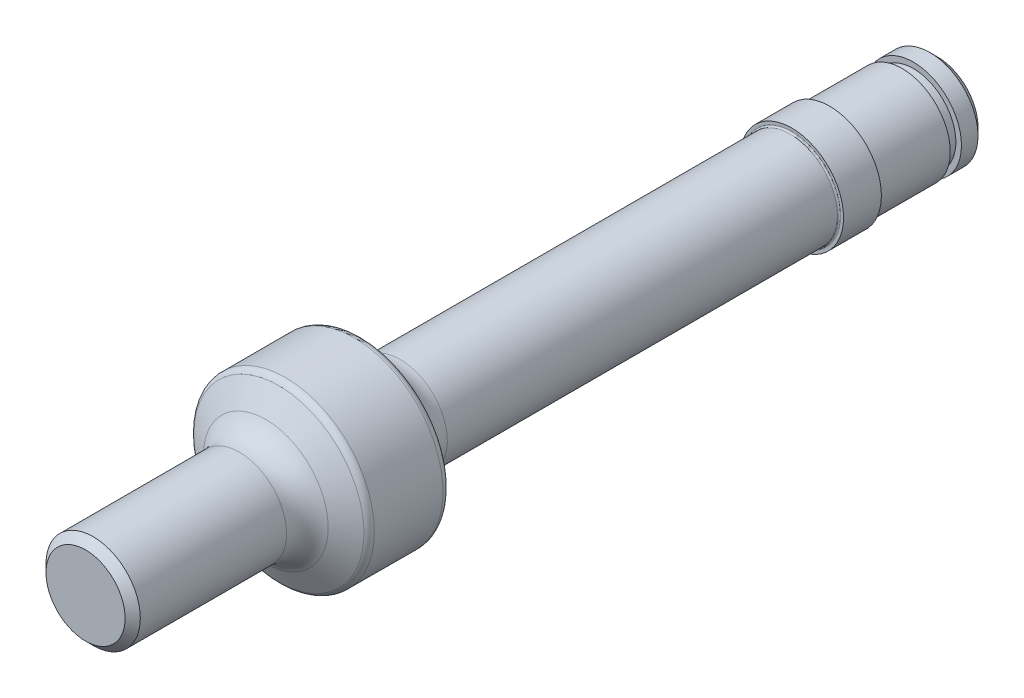
ISO-10303-21;
HEADER;
FILE_DESCRIPTION(('STEP AP214'),'2;1');
FILE_NAME('part.step','',(''),(''),'','','');
FILE_SCHEMA(('AUTOMOTIVE_DESIGN { 1 0 10303 214 1 1 1 1 }'));
ENDSEC;
DATA;
#1=APPLICATION_CONTEXT('core data for automotive mechanical design processes');
#2=APPLICATION_PROTOCOL_DEFINITION('international standard','automotive_design',2000,#1);
#3=PRODUCT_CONTEXT('',#1,'mechanical');
#4=PRODUCT('Part','Part','',(#3));
#5=PRODUCT_RELATED_PRODUCT_CATEGORY('part','',(#4));
#6=PRODUCT_DEFINITION_FORMATION('','',#4);
#7=PRODUCT_DEFINITION_CONTEXT('part definition',#1,'design');
#8=PRODUCT_DEFINITION('design','',#6,#7);
#9=PRODUCT_DEFINITION_SHAPE('','',#8);
#10=(LENGTH_UNIT() NAMED_UNIT(*) SI_UNIT(.MILLI.,.METRE.));
#11=(NAMED_UNIT(*) PLANE_ANGLE_UNIT() SI_UNIT($,.RADIAN.));
#12=(NAMED_UNIT(*) SI_UNIT($,.STERADIAN.) SOLID_ANGLE_UNIT());
#13=UNCERTAINTY_MEASURE_WITH_UNIT(LENGTH_MEASURE(1.E-05),#10,'distance_accuracy_value','');
#14=(GEOMETRIC_REPRESENTATION_CONTEXT(3) GLOBAL_UNCERTAINTY_ASSIGNED_CONTEXT((#13)) GLOBAL_UNIT_ASSIGNED_CONTEXT((#10,
#11,#12)) REPRESENTATION_CONTEXT('',''));
#15=CARTESIAN_POINT('',(0.,0.,0.));
#16=DIRECTION('',(0.,0.,1.));
#17=DIRECTION('',(1.,0.,0.));
#18=AXIS2_PLACEMENT_3D('',#15,#16,#17);
#19=CARTESIAN_POINT('',(0.,3.1623,-40.6019));
#20=DIRECTION('',(0.,0.,1.));
#21=DIRECTION('',(1.,0.,0.));
#22=AXIS2_PLACEMENT_3D('',#19,#20,#21);
#23=PLANE('',#22);
#24=CARTESIAN_POINT('',(0.,0.,-40.6019000000697));
#25=DIRECTION('',(0.,0.,1.));
#26=DIRECTION('',(1.,0.,0.));
#27=AXIS2_PLACEMENT_3D('',#24,#25,#26);
#28=CIRCLE('',#27,2.66229999999723);
#29=CARTESIAN_POINT('',(2.66229999999723,0.,-40.6019000000697));
#30=VERTEX_POINT('',#29);
#31=EDGE_CURVE('E257',#30,#30,#28,.T.);
#32=ORIENTED_EDGE('',*,*,#31,.F.);
#33=EDGE_LOOP('',(#32));
#34=FACE_BOUND('',#33,.T.);
#35=ADVANCED_FACE('F16',(#34),#23,.F.);
#36=CARTESIAN_POINT('',(0.,0.,-40.1019000000247));
#37=DIRECTION('',(0.,0.,1.));
#38=DIRECTION('',(1.,0.,0.));
#39=AXIS2_PLACEMENT_3D('',#36,#37,#38);
#40=CONICAL_SURFACE('',#39,3.16230000004225,0.785398163397448);
#41=ORIENTED_EDGE('',*,*,#31,.T.);
#42=EDGE_LOOP('',(#41));
#43=FACE_BOUND('',#42,.T.);
#44=CARTESIAN_POINT('',(0.,0.,-40.1019));
#45=DIRECTION('',(0.,0.,1.));
#46=DIRECTION('',(1.,0.,0.));
#47=AXIS2_PLACEMENT_3D('',#44,#45,#46);
#48=CIRCLE('',#47,3.1623);
#49=CARTESIAN_POINT('',(3.1623,0.,-40.1019));
#50=VERTEX_POINT('',#49);
#51=EDGE_CURVE('E256',#50,#50,#48,.T.);
#52=ORIENTED_EDGE('',*,*,#51,.F.);
#53=EDGE_LOOP('',(#52));
#54=FACE_BOUND('',#53,.T.);
#55=ADVANCED_FACE('F148',(#43,#54),#40,.T.);
#56=CARTESIAN_POINT('',(0.,0.,26.453846));
#57=DIRECTION('',(0.,0.,1.));
#58=DIRECTION('',(1.,0.,0.));
#59=AXIS2_PLACEMENT_3D('',#56,#57,#58);
#60=CYLINDRICAL_SURFACE('',#59,3.1623);
#61=ORIENTED_EDGE('',*,*,#51,.T.);
#62=EDGE_LOOP('',(#61));
#63=FACE_BOUND('',#62,.T.);
#64=CARTESIAN_POINT('',(0.,0.,-39.0144));
#65=DIRECTION('',(0.,0.,1.));
#66=DIRECTION('',(1.,0.,0.));
#67=AXIS2_PLACEMENT_3D('',#64,#65,#66);
#68=CIRCLE('',#67,3.1623);
#69=CARTESIAN_POINT('',(3.1623,0.,-39.0144));
#70=VERTEX_POINT('',#69);
#71=EDGE_CURVE('E253',#70,#70,#68,.F.);
#72=ORIENTED_EDGE('',*,*,#71,.T.);
#73=EDGE_LOOP('',(#72));
#74=FACE_BOUND('',#73,.T.);
#75=ADVANCED_FACE('F145',(#63,#74),#60,.T.);
#76=CARTESIAN_POINT('',(0.,3.10000000000002,15.3981));
#77=DIRECTION('',(0.,0.,-1.));
#78=DIRECTION('',(-1.,0.,0.));
#79=AXIS2_PLACEMENT_3D('',#76,#77,#78);
#80=PLANE('',#79);
#81=CARTESIAN_POINT('',(0.,0.,15.3980999999703));
#82=DIRECTION('',(0.,0.,-1.));
#83=DIRECTION('',(-1.,0.,0.));
#84=AXIS2_PLACEMENT_3D('',#81,#82,#83);
#85=CIRCLE('',#84,2.59999999991578);
#86=CARTESIAN_POINT('',(-2.59999999991578,0.,15.3980999999703));
#87=VERTEX_POINT('',#86);
#88=EDGE_CURVE('E250',#87,#87,#85,.T.);
#89=ORIENTED_EDGE('',*,*,#88,.F.);
#90=EDGE_LOOP('',(#89));
#91=FACE_BOUND('',#90,.T.);
#92=ADVANCED_FACE('F141',(#91),#80,.F.);
#93=CARTESIAN_POINT('',(0.,2.794,-39.0144));
#94=DIRECTION('',(0.,0.,-1.));
#95=DIRECTION('',(-1.,0.,0.));
#96=AXIS2_PLACEMENT_3D('',#93,#94,#95);
#97=PLANE('',#96);
#98=CARTESIAN_POINT('',(0.,0.,-39.0144));
#99=DIRECTION('',(0.,0.,-1.));
#100=DIRECTION('',(-1.,0.,0.));
#101=AXIS2_PLACEMENT_3D('',#98,#99,#100);
#102=CIRCLE('',#101,2.794);
#103=CARTESIAN_POINT('',(-2.794,0.,-39.0144));
#104=VERTEX_POINT('',#103);
#105=EDGE_CURVE('E247',#104,#104,#102,.F.);
#106=ORIENTED_EDGE('',*,*,#105,.F.);
#107=EDGE_LOOP('',(#106));
#108=FACE_BOUND('',#107,.T.);
#109=ORIENTED_EDGE('',*,*,#71,.F.);
#110=EDGE_LOOP('',(#109));
#111=FACE_BOUND('',#110,.T.);
#112=ADVANCED_FACE('F137',(#108,#111),#97,.F.);
#113=CARTESIAN_POINT('',(0.,0.,14.898100000039));
#114=DIRECTION('',(0.,0.,-1.));
#115=DIRECTION('',(-1.,0.,0.));
#116=AXIS2_PLACEMENT_3D('',#113,#114,#115);
#117=CONICAL_SURFACE('',#116,3.09999999984711,0.785398163397448);
#118=CARTESIAN_POINT('',(0.,0.,14.8981));
#119=DIRECTION('',(0.,0.,1.));
#120=DIRECTION('',(1.,0.,0.));
#121=AXIS2_PLACEMENT_3D('',#118,#119,#120);
#122=CIRCLE('',#121,3.10000000000001);
#123=CARTESIAN_POINT('',(3.10000000000001,0.,14.8981));
#124=VERTEX_POINT('',#123);
#125=EDGE_CURVE('E246',#124,#124,#122,.F.);
#126=ORIENTED_EDGE('',*,*,#125,.F.);
#127=EDGE_LOOP('',(#126));
#128=FACE_BOUND('',#127,.T.);
#129=ORIENTED_EDGE('',*,*,#88,.T.);
#130=EDGE_LOOP('',(#129));
#131=FACE_BOUND('',#130,.T.);
#132=ADVANCED_FACE('F133',(#128,#131),#117,.T.);
#133=CARTESIAN_POINT('',(0.,0.,-40.0654390361338));
#134=DIRECTION('',(0.,0.,-1.));
#135=DIRECTION('',(-1.,0.,0.));
#136=AXIS2_PLACEMENT_3D('',#133,#134,#135);
#137=CYLINDRICAL_SURFACE('',#136,2.794);
#138=ORIENTED_EDGE('',*,*,#105,.T.);
#139=EDGE_LOOP('',(#138));
#140=FACE_BOUND('',#139,.T.);
#141=CARTESIAN_POINT('',(0.,0.,-38.2778));
#142=DIRECTION('',(0.,0.,-1.));
#143=DIRECTION('',(-1.,0.,0.));
#144=AXIS2_PLACEMENT_3D('',#141,#142,#143);
#145=CIRCLE('',#144,2.794);
#146=CARTESIAN_POINT('',(-2.794,0.,-38.2778));
#147=VERTEX_POINT('',#146);
#148=EDGE_CURVE('E243',#147,#147,#145,.T.);
#149=ORIENTED_EDGE('',*,*,#148,.T.);
#150=EDGE_LOOP('',(#149));
#151=FACE_BOUND('',#150,.T.);
#152=ADVANCED_FACE('F129',(#140,#151),#137,.T.);
#153=CARTESIAN_POINT('',(0.,0.,26.453846));
#154=DIRECTION('',(0.,0.,1.));
#155=DIRECTION('',(1.,0.,0.));
#156=AXIS2_PLACEMENT_3D('',#153,#154,#155);
#157=CYLINDRICAL_SURFACE('',#156,3.10000000000001);
#158=CARTESIAN_POINT('',(0.,0.,5.28374149423676));
#159=DIRECTION('',(0.,0.,1.));
#160=DIRECTION('',(1.,0.,0.));
#161=AXIS2_PLACEMENT_3D('',#158,#159,#160);
#162=CIRCLE('',#161,3.10000000000001);
#163=CARTESIAN_POINT('',(3.10000000000001,0.,5.28374149423676));
#164=VERTEX_POINT('',#163);
#165=EDGE_CURVE('E114',#164,#164,#162,.T.);
#166=ORIENTED_EDGE('',*,*,#165,.T.);
#167=EDGE_LOOP('',(#166));
#168=FACE_BOUND('',#167,.T.);
#169=ORIENTED_EDGE('',*,*,#125,.T.);
#170=EDGE_LOOP('',(#169));
#171=FACE_BOUND('',#170,.T.);
#172=ADVANCED_FACE('F125',(#168,#171),#157,.T.);
#173=CARTESIAN_POINT('',(0.,2.794,-38.2778));
#174=DIRECTION('',(0.,0.,1.));
#175=DIRECTION('',(1.,0.,0.));
#176=AXIS2_PLACEMENT_3D('',#173,#174,#175);
#177=PLANE('',#176);
#178=CARTESIAN_POINT('',(0.,0.,-38.2778));
#179=DIRECTION('',(0.,0.,1.));
#180=DIRECTION('',(1.,0.,0.));
#181=AXIS2_PLACEMENT_3D('',#178,#179,#180);
#182=CIRCLE('',#181,3.1623);
#183=CARTESIAN_POINT('',(3.1623,0.,-38.2778));
#184=VERTEX_POINT('',#183);
#185=EDGE_CURVE('E109',#184,#184,#182,.T.);
#186=ORIENTED_EDGE('',*,*,#185,.F.);
#187=EDGE_LOOP('',(#186));
#188=FACE_BOUND('',#187,.T.);
#189=ORIENTED_EDGE('',*,*,#148,.F.);
#190=EDGE_LOOP('',(#189));
#191=FACE_BOUND('',#190,.T.);
#192=ADVANCED_FACE('F121',(#188,#191),#177,.F.);
#193=CARTESIAN_POINT('',(0.,0.,5.28374149423676));
#194=DIRECTION('',(0.,0.,1.));
#195=DIRECTION('',(1.,0.,0.));
#196=AXIS2_PLACEMENT_3D('',#193,#194,#195);
#197=TOROIDAL_SURFACE('',#196,5.10000000000001,2.);
#198=CARTESIAN_POINT('',(0.,0.,3.55169068666328));
#199=DIRECTION('',(0.,0.,-1.));
#200=DIRECTION('',(-1.,0.,0.));
#201=AXIS2_PLACEMENT_3D('',#198,#199,#200);
#202=CIRCLE('',#201,4.099999999994);
#203=CARTESIAN_POINT('',(-4.099999999994,0.,3.55169068666328));
#204=VERTEX_POINT('',#203);
#205=EDGE_CURVE('E101',#204,#204,#202,.T.);
#206=ORIENTED_EDGE('',*,*,#205,.F.);
#207=EDGE_LOOP('',(#206));
#208=FACE_BOUND('',#207,.T.);
#209=ORIENTED_EDGE('',*,*,#165,.F.);
#210=EDGE_LOOP('',(#209));
#211=FACE_BOUND('',#210,.T.);
#212=ADVANCED_FACE('F117',(#208,#211),#197,.F.);
#213=CARTESIAN_POINT('',(0.,0.,26.453846));
#214=DIRECTION('',(0.,0.,1.));
#215=DIRECTION('',(1.,0.,0.));
#216=AXIS2_PLACEMENT_3D('',#213,#214,#215);
#217=CYLINDRICAL_SURFACE('',#216,3.1623);
#218=CARTESIAN_POINT('',(0.,0.,-33.6153));
#219=DIRECTION('',(0.,0.,1.));
#220=DIRECTION('',(1.,0.,0.));
#221=AXIS2_PLACEMENT_3D('',#218,#219,#220);
#222=CIRCLE('',#221,3.1623);
#223=CARTESIAN_POINT('',(3.1623,0.,-33.6153));
#224=VERTEX_POINT('',#223);
#225=EDGE_CURVE('E90',#224,#224,#222,.F.);
#226=ORIENTED_EDGE('',*,*,#225,.T.);
#227=EDGE_LOOP('',(#226));
#228=FACE_BOUND('',#227,.T.);
#229=ORIENTED_EDGE('',*,*,#185,.T.);
#230=EDGE_LOOP('',(#229));
#231=FACE_BOUND('',#230,.T.);
#232=ADVANCED_FACE('F120',(#228,#231),#217,.T.);
#233=CARTESIAN_POINT('',(0.,0.,2.69028408507666));
#234=DIRECTION('',(0.,0.,-1.));
#235=DIRECTION('',(-1.,0.,0.));
#236=AXIS2_PLACEMENT_3D('',#233,#234,#235);
#237=CONICAL_SURFACE('',#236,5.59199999992188,1.04719755119794);
#238=CARTESIAN_POINT('',(0.,0.,2.69028408503697));
#239=DIRECTION('',(0.,0.,-1.));
#240=DIRECTION('',(-1.,0.,0.));
#241=AXIS2_PLACEMENT_3D('',#238,#239,#240);
#242=CIRCLE('',#241,5.59199999999999);
#243=CARTESIAN_POINT('',(-5.59199999999999,0.,2.69028408503697));
#244=VERTEX_POINT('',#243);
#245=EDGE_CURVE('E57',#244,#244,#242,.T.);
#246=ORIENTED_EDGE('',*,*,#245,.F.);
#247=EDGE_LOOP('',(#246));
#248=FACE_BOUND('',#247,.T.);
#249=ORIENTED_EDGE('',*,*,#205,.T.);
#250=EDGE_LOOP('',(#249));
#251=FACE_BOUND('',#250,.T.);
#252=ADVANCED_FACE('F95',(#248,#251),#237,.T.);
#253=CARTESIAN_POINT('',(0.,0.,-33.6153));
#254=DIRECTION('',(0.,0.,1.));
#255=DIRECTION('',(1.,0.,0.));
#256=AXIS2_PLACEMENT_3D('',#253,#254,#255);
#257=TOROIDAL_SURFACE('',#256,3.2623,0.1);
#258=CARTESIAN_POINT('',(0.,0.,-33.5153));
#259=DIRECTION('',(0.,0.,-1.));
#260=DIRECTION('',(-1.,0.,0.));
#261=AXIS2_PLACEMENT_3D('',#258,#259,#260);
#262=CIRCLE('',#261,3.2623);
#263=CARTESIAN_POINT('',(-3.2623,0.,-33.5153));
#264=VERTEX_POINT('',#263);
#265=CARTESIAN_POINT('',(3.2623,0.,-33.5153));
#266=VERTEX_POINT('',#265);
#267=EDGE_CURVE('E46',#264,#266,#262,.T.);
#268=ORIENTED_EDGE('',*,*,#267,.T.);
#269=CARTESIAN_POINT('',(0.,0.,-33.5153));
#270=DIRECTION('',(0.,0.,-1.));
#271=DIRECTION('',(1.,0.,0.));
#272=AXIS2_PLACEMENT_3D('',#269,#270,#271);
#273=CIRCLE('',#272,3.2623);
#274=EDGE_CURVE('E44',#266,#264,#273,.T.);
#275=ORIENTED_EDGE('',*,*,#274,.T.);
#276=EDGE_LOOP('',(#268,#275));
#277=FACE_BOUND('',#276,.T.);
#278=ORIENTED_EDGE('',*,*,#225,.F.);
#279=EDGE_LOOP('',(#278));
#280=FACE_BOUND('',#279,.T.);
#281=ADVANCED_FACE('F48',(#277,#280),#257,.F.);
#282=CARTESIAN_POINT('',(0.,0.,2.25727138314476));
#283=DIRECTION('',(0.,0.,-1.));
#284=DIRECTION('',(-1.,0.,0.));
#285=AXIS2_PLACEMENT_3D('',#282,#283,#284);
#286=TOROIDAL_SURFACE('',#285,5.34199999999999,0.5);
#287=CARTESIAN_POINT('',(0.,0.,2.25727138314476));
#288=DIRECTION('',(0.,0.,1.));
#289=DIRECTION('',(1.,0.,0.));
#290=AXIS2_PLACEMENT_3D('',#287,#288,#289);
#291=CIRCLE('',#290,5.842);
#292=CARTESIAN_POINT('',(5.842,0.,2.25727138314476));
#293=VERTEX_POINT('',#292);
#294=EDGE_CURVE('E52',#293,#293,#291,.F.);
#295=ORIENTED_EDGE('',*,*,#294,.F.);
#296=EDGE_LOOP('',(#295));
#297=FACE_BOUND('',#296,.T.);
#298=ORIENTED_EDGE('',*,*,#245,.T.);
#299=EDGE_LOOP('',(#298));
#300=FACE_BOUND('',#299,.T.);
#301=ADVANCED_FACE('F75',(#297,#300),#286,.T.);
#302=CARTESIAN_POINT('',(0.,3.4,-33.5153));
#303=DIRECTION('',(0.,0.,1.));
#304=DIRECTION('',(1.,0.,0.));
#305=AXIS2_PLACEMENT_3D('',#302,#303,#304);
#306=PLANE('',#305);
#307=CARTESIAN_POINT('',(0.,0.,-33.5153));
#308=DIRECTION('',(0.,0.,1.));
#309=DIRECTION('',(1.,0.,0.));
#310=AXIS2_PLACEMENT_3D('',#307,#308,#309);
#311=CIRCLE('',#310,3.4);
#312=CARTESIAN_POINT('',(3.4,0.,-33.5153));
#313=VERTEX_POINT('',#312);
#314=EDGE_CURVE('E229',#313,#313,#311,.T.);
#315=ORIENTED_EDGE('',*,*,#314,.F.);
#316=EDGE_LOOP('',(#315));
#317=FACE_BOUND('',#316,.T.);
#318=ORIENTED_EDGE('',*,*,#274,.F.);
#319=ORIENTED_EDGE('',*,*,#267,.F.);
#320=EDGE_LOOP('',(#318,#319));
#321=FACE_BOUND('',#320,.T.);
#322=ADVANCED_FACE('F56',(#317,#321),#306,.F.);
#323=CARTESIAN_POINT('',(0.,0.,26.453846));
#324=DIRECTION('',(0.,0.,1.));
#325=DIRECTION('',(1.,0.,0.));
#326=AXIS2_PLACEMENT_3D('',#323,#324,#325);
#327=CYLINDRICAL_SURFACE('',#326,5.842);
#328=CARTESIAN_POINT('',(0.,0.,-2.25727138314476));
#329=DIRECTION('',(0.,0.,-1.));
#330=DIRECTION('',(-1.,0.,0.));
#331=AXIS2_PLACEMENT_3D('',#328,#329,#330);
#332=CIRCLE('',#331,5.842);
#333=CARTESIAN_POINT('',(-5.842,0.,-2.25727138314476));
#334=VERTEX_POINT('',#333);
#335=EDGE_CURVE('E226',#334,#334,#332,.T.);
#336=ORIENTED_EDGE('',*,*,#335,.F.);
#337=EDGE_LOOP('',(#336));
#338=FACE_BOUND('',#337,.T.);
#339=ORIENTED_EDGE('',*,*,#294,.T.);
#340=EDGE_LOOP('',(#339));
#341=FACE_BOUND('',#340,.T.);
#342=ADVANCED_FACE('F74',(#338,#341),#327,.T.);
#343=CARTESIAN_POINT('',(0.,0.,26.453846));
#344=DIRECTION('',(0.,0.,1.));
#345=DIRECTION('',(1.,0.,0.));
#346=AXIS2_PLACEMENT_3D('',#343,#344,#345);
#347=CYLINDRICAL_SURFACE('',#346,3.4);
#348=CARTESIAN_POINT('',(0.,0.,-31.0261));
#349=DIRECTION('',(0.,0.,1.));
#350=DIRECTION('',(1.,0.,0.));
#351=AXIS2_PLACEMENT_3D('',#348,#349,#350);
#352=CIRCLE('',#351,3.4);
#353=CARTESIAN_POINT('',(3.4,0.,-31.0261));
#354=VERTEX_POINT('',#353);
#355=EDGE_CURVE('E228',#354,#354,#352,.F.);
#356=ORIENTED_EDGE('',*,*,#355,.T.);
#357=EDGE_LOOP('',(#356));
#358=FACE_BOUND('',#357,.T.);
#359=ORIENTED_EDGE('',*,*,#314,.T.);
#360=EDGE_LOOP('',(#359));
#361=FACE_BOUND('',#360,.T.);
#362=ADVANCED_FACE('F282',(#358,#361),#347,.T.);
#363=CARTESIAN_POINT('',(0.,0.,-2.25727138314476));
#364=DIRECTION('',(0.,0.,-1.));
#365=DIRECTION('',(-1.,0.,0.));
#366=AXIS2_PLACEMENT_3D('',#363,#364,#365);
#367=TOROIDAL_SURFACE('',#366,5.34199999999999,0.5);
#368=CARTESIAN_POINT('',(0.,0.,-2.69028408501981));
#369=DIRECTION('',(0.,0.,1.));
#370=DIRECTION('',(1.,0.,0.));
#371=AXIS2_PLACEMENT_3D('',#368,#369,#370);
#372=CIRCLE('',#371,5.59199999997873);
#373=CARTESIAN_POINT('',(5.59199999997872,0.,-2.69028408501981));
#374=VERTEX_POINT('',#373);
#375=EDGE_CURVE('E185',#374,#374,#372,.F.);
#376=ORIENTED_EDGE('',*,*,#375,.F.);
#377=EDGE_LOOP('',(#376));
#378=FACE_BOUND('',#377,.T.);
#379=ORIENTED_EDGE('',*,*,#335,.T.);
#380=EDGE_LOOP('',(#379));
#381=FACE_BOUND('',#380,.T.);
#382=ADVANCED_FACE('F203',(#378,#381),#367,.T.);
#383=CARTESIAN_POINT('',(0.,3.4,-31.0261));
#384=DIRECTION('',(0.,0.,-1.));
#385=DIRECTION('',(-1.,0.,0.));
#386=AXIS2_PLACEMENT_3D('',#383,#384,#385);
#387=PLANE('',#386);
#388=ORIENTED_EDGE('',*,*,#355,.F.);
#389=EDGE_LOOP('',(#388));
#390=FACE_BOUND('',#389,.T.);
#391=CARTESIAN_POINT('',(0.,0.,-31.0261));
#392=DIRECTION('',(0.,0.,1.));
#393=DIRECTION('',(-1.,0.,0.));
#394=AXIS2_PLACEMENT_3D('',#391,#392,#393);
#395=CIRCLE('',#394,3.19999999999995);
#396=CARTESIAN_POINT('',(3.19999999999995,0.,-31.0261));
#397=VERTEX_POINT('',#396);
#398=CARTESIAN_POINT('',(-3.19999999999995,0.,-31.0261));
#399=VERTEX_POINT('',#398);
#400=EDGE_CURVE('E182',#397,#399,#395,.F.);
#401=ORIENTED_EDGE('',*,*,#400,.T.);
#402=CARTESIAN_POINT('',(0.,0.,-31.0261));
#403=DIRECTION('',(0.,0.,1.));
#404=DIRECTION('',(1.,0.,0.));
#405=AXIS2_PLACEMENT_3D('',#402,#403,#404);
#406=CIRCLE('',#405,3.19999999999995);
#407=EDGE_CURVE('E35',#399,#397,#406,.F.);
#408=ORIENTED_EDGE('',*,*,#407,.T.);
#409=EDGE_LOOP('',(#401,#408));
#410=FACE_BOUND('',#409,.T.);
#411=ADVANCED_FACE('F193',(#390,#410),#387,.F.);
#412=CARTESIAN_POINT('',(0.,0.,-2.69028408507666));
#413=DIRECTION('',(0.,0.,1.));
#414=DIRECTION('',(1.,0.,0.));
#415=AXIS2_PLACEMENT_3D('',#412,#413,#414);
#416=CONICAL_SURFACE('',#415,5.59199999992188,1.04719755119794);
#417=ORIENTED_EDGE('',*,*,#375,.T.);
#418=EDGE_LOOP('',(#417));
#419=FACE_BOUND('',#418,.T.);
#420=CARTESIAN_POINT('',(0.,0.,-3.55169068666792));
#421=DIRECTION('',(0.,0.,1.));
#422=DIRECTION('',(1.,0.,0.));
#423=AXIS2_PLACEMENT_3D('',#420,#421,#422);
#424=CIRCLE('',#423,4.09999999999995);
#425=CARTESIAN_POINT('',(4.09999999999995,0.,-3.55169068666792));
#426=VERTEX_POINT('',#425);
#427=EDGE_CURVE('E180',#426,#426,#424,.T.);
#428=ORIENTED_EDGE('',*,*,#427,.T.);
#429=EDGE_LOOP('',(#428));
#430=FACE_BOUND('',#429,.T.);
#431=ADVANCED_FACE('F202',(#419,#430),#416,.T.);
#432=CARTESIAN_POINT('',(0.,0.,-30.9261));
#433=DIRECTION('',(0.,0.,-1.));
#434=DIRECTION('',(-1.,0.,0.));
#435=AXIS2_PLACEMENT_3D('',#432,#433,#434);
#436=TOROIDAL_SURFACE('',#435,3.19999999999995,0.1);
#437=CARTESIAN_POINT('',(0.,0.,-30.9261));
#438=DIRECTION('',(0.,0.,1.));
#439=DIRECTION('',(1.,0.,0.));
#440=AXIS2_PLACEMENT_3D('',#437,#438,#439);
#441=CIRCLE('',#440,3.09999999999995);
#442=CARTESIAN_POINT('',(3.09999999999995,0.,-30.9261));
#443=VERTEX_POINT('',#442);
#444=EDGE_CURVE('E27',#443,#443,#441,.T.);
#445=ORIENTED_EDGE('',*,*,#444,.F.);
#446=EDGE_LOOP('',(#445));
#447=FACE_BOUND('',#446,.T.);
#448=ORIENTED_EDGE('',*,*,#400,.F.);
#449=ORIENTED_EDGE('',*,*,#407,.F.);
#450=EDGE_LOOP('',(#448,#449));
#451=FACE_BOUND('',#450,.T.);
#452=ADVANCED_FACE('F168',(#447,#451),#436,.F.);
#453=CARTESIAN_POINT('',(0.,0.,-5.2837414942368));
#454=DIRECTION('',(0.,0.,1.));
#455=DIRECTION('',(1.,0.,0.));
#456=AXIS2_PLACEMENT_3D('',#453,#454,#455);
#457=TOROIDAL_SURFACE('',#456,5.09999999999995,2.);
#458=CARTESIAN_POINT('',(0.,0.,-5.2837414942368));
#459=DIRECTION('',(0.,0.,1.));
#460=DIRECTION('',(1.,0.,0.));
#461=AXIS2_PLACEMENT_3D('',#458,#459,#460);
#462=CIRCLE('',#461,3.09999999999995);
#463=CARTESIAN_POINT('',(3.09999999999995,0.,-5.2837414942368));
#464=VERTEX_POINT('',#463);
#465=EDGE_CURVE('E11',#464,#464,#462,.F.);
#466=ORIENTED_EDGE('',*,*,#465,.F.);
#467=EDGE_LOOP('',(#466));
#468=FACE_BOUND('',#467,.T.);
#469=ORIENTED_EDGE('',*,*,#427,.F.);
#470=EDGE_LOOP('',(#469));
#471=FACE_BOUND('',#470,.T.);
#472=ADVANCED_FACE('F162',(#468,#471),#457,.F.);
#473=CARTESIAN_POINT('',(0.,0.,26.453846));
#474=DIRECTION('',(0.,0.,1.));
#475=DIRECTION('',(1.,0.,0.));
#476=AXIS2_PLACEMENT_3D('',#473,#474,#475);
#477=CYLINDRICAL_SURFACE('',#476,3.09999999999995);
#478=ORIENTED_EDGE('',*,*,#444,.T.);
#479=EDGE_LOOP('',(#478));
#480=FACE_BOUND('',#479,.T.);
#481=ORIENTED_EDGE('',*,*,#465,.T.);
#482=EDGE_LOOP('',(#481));
#483=FACE_BOUND('',#482,.T.);
#484=ADVANCED_FACE('F160',(#480,#483),#477,.T.);
#485=CLOSED_SHELL('',(#35,#55,#75,#92,#112,#132,#152,#172,#192,#212,#232,#252,#281,#301,#322,
#342,#362,#382,#411,#431,#452,#472,#484));
#486=MANIFOLD_SOLID_BREP('B1',#485);
#487=ADVANCED_BREP_SHAPE_REPRESENTATION('',(#18,#486),#14);
#488=SHAPE_DEFINITION_REPRESENTATION(#9,#487);
ENDSEC;
END-ISO-10303-21;
